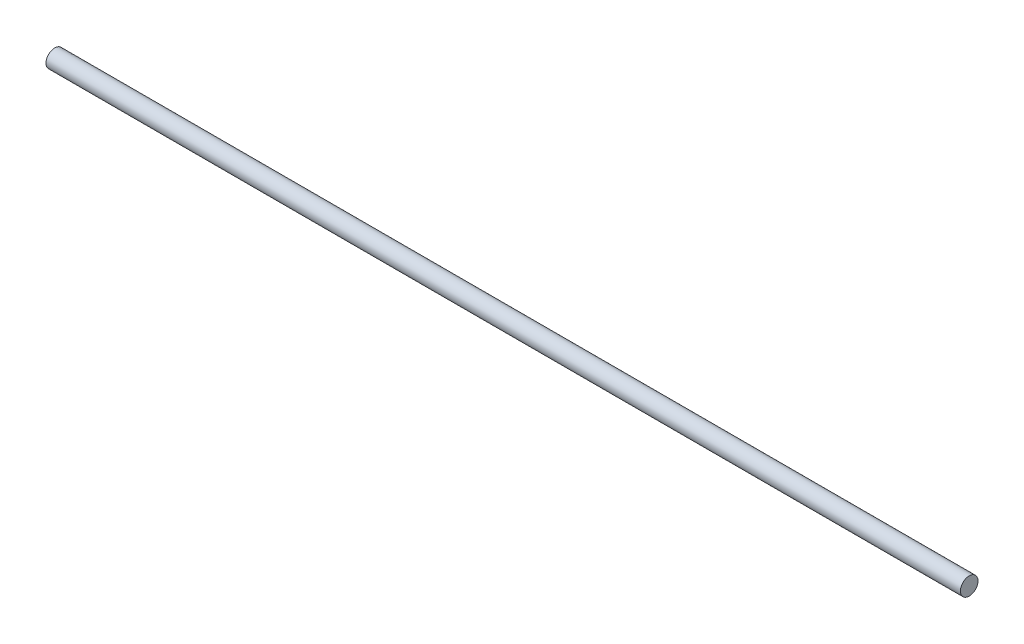
ISO-10303-21;
HEADER;
FILE_DESCRIPTION(('STEP AP214'),'2;1');
FILE_NAME('part.step','',(''),(''),'','','');
FILE_SCHEMA(('AUTOMOTIVE_DESIGN { 1 0 10303 214 1 1 1 1 }'));
ENDSEC;
DATA;
#1=APPLICATION_CONTEXT('core data for automotive mechanical design processes');
#2=APPLICATION_PROTOCOL_DEFINITION('international standard','automotive_design',2000,#1);
#3=PRODUCT_CONTEXT('',#1,'mechanical');
#4=PRODUCT('Part','Part','',(#3));
#5=PRODUCT_RELATED_PRODUCT_CATEGORY('part','',(#4));
#6=PRODUCT_DEFINITION_FORMATION('','',#4);
#7=PRODUCT_DEFINITION_CONTEXT('part definition',#1,'design');
#8=PRODUCT_DEFINITION('design','',#6,#7);
#9=PRODUCT_DEFINITION_SHAPE('','',#8);
#10=(LENGTH_UNIT() NAMED_UNIT(*) SI_UNIT(.MILLI.,.METRE.));
#11=(NAMED_UNIT(*) PLANE_ANGLE_UNIT() SI_UNIT($,.RADIAN.));
#12=(NAMED_UNIT(*) SI_UNIT($,.STERADIAN.) SOLID_ANGLE_UNIT());
#13=UNCERTAINTY_MEASURE_WITH_UNIT(LENGTH_MEASURE(1.E-05),#10,'distance_accuracy_value','');
#14=(GEOMETRIC_REPRESENTATION_CONTEXT(3) GLOBAL_UNCERTAINTY_ASSIGNED_CONTEXT((#13)) GLOBAL_UNIT_ASSIGNED_CONTEXT((#10,
#11,#12)) REPRESENTATION_CONTEXT('',''));
#15=CARTESIAN_POINT('',(0.,0.,0.));
#16=DIRECTION('',(0.,0.,1.));
#17=DIRECTION('',(1.,0.,0.));
#18=AXIS2_PLACEMENT_3D('',#15,#16,#17);
#19=CARTESIAN_POINT('',(260.,0.,0.));
#20=DIRECTION('',(-1.,0.,0.));
#21=DIRECTION('',(0.,0.,1.));
#22=AXIS2_PLACEMENT_3D('',#19,#20,#21);
#23=CYLINDRICAL_SURFACE('',#22,5.);
#24=CARTESIAN_POINT('',(260.,0.,0.));
#25=DIRECTION('',(1.,0.,0.));
#26=DIRECTION('',(0.,0.,-1.));
#27=AXIS2_PLACEMENT_3D('',#24,#25,#26);
#28=CIRCLE('',#27,5.);
#29=CARTESIAN_POINT('',(260.,0.,-5.));
#30=VERTEX_POINT('',#29);
#31=EDGE_CURVE('E10',#30,#30,#28,.T.);
#32=ORIENTED_EDGE('',*,*,#31,.F.);
#33=EDGE_LOOP('',(#32));
#34=FACE_BOUND('',#33,.T.);
#35=CARTESIAN_POINT('',(-260.,0.,0.));
#36=DIRECTION('',(1.,0.,0.));
#37=DIRECTION('',(0.,0.,-1.));
#38=AXIS2_PLACEMENT_3D('',#35,#36,#37);
#39=CIRCLE('',#38,5.);
#40=CARTESIAN_POINT('',(-260.,0.,-5.));
#41=VERTEX_POINT('',#40);
#42=EDGE_CURVE('E37',#41,#41,#39,.T.);
#43=ORIENTED_EDGE('',*,*,#42,.T.);
#44=EDGE_LOOP('',(#43));
#45=FACE_BOUND('',#44,.T.);
#46=ADVANCED_FACE('F34',(#34,#45),#23,.T.);
#47=CARTESIAN_POINT('',(260.,0.,0.));
#48=DIRECTION('',(1.,0.,0.));
#49=DIRECTION('',(0.,0.,-1.));
#50=AXIS2_PLACEMENT_3D('',#47,#48,#49);
#51=PLANE('',#50);
#52=ORIENTED_EDGE('',*,*,#31,.T.);
#53=EDGE_LOOP('',(#52));
#54=FACE_BOUND('',#53,.T.);
#55=ADVANCED_FACE('F49',(#54),#51,.T.);
#56=CARTESIAN_POINT('',(-260.,0.,0.));
#57=DIRECTION('',(1.,0.,0.));
#58=DIRECTION('',(0.,0.,-1.));
#59=AXIS2_PLACEMENT_3D('',#56,#57,#58);
#60=PLANE('',#59);
#61=ORIENTED_EDGE('',*,*,#42,.F.);
#62=EDGE_LOOP('',(#61));
#63=FACE_BOUND('',#62,.T.);
#64=ADVANCED_FACE('F47',(#63),#60,.F.);
#65=CLOSED_SHELL('',(#46,#55,#64));
#66=MANIFOLD_SOLID_BREP('B2',#65);
#67=ADVANCED_BREP_SHAPE_REPRESENTATION('',(#18,#66),#14);
#68=SHAPE_DEFINITION_REPRESENTATION(#9,#67);
ENDSEC;
END-ISO-10303-21;
